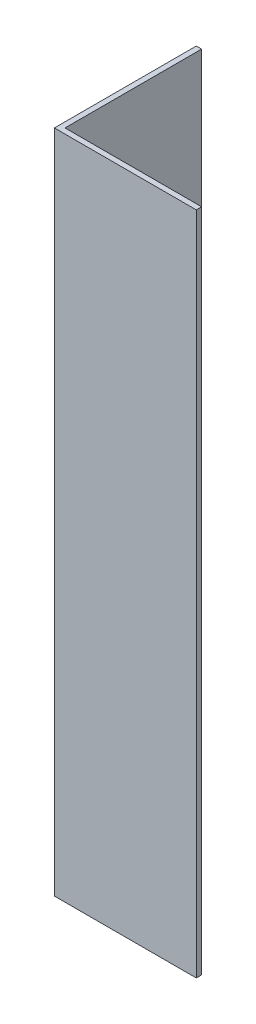
ISO-10303-21;
HEADER;
FILE_DESCRIPTION(('STEP AP214'),'2;1');
FILE_NAME('part.step','',(''),(''),'','','');
FILE_SCHEMA(('AUTOMOTIVE_DESIGN { 1 0 10303 214 1 1 1 1 }'));
ENDSEC;
DATA;
#1=APPLICATION_CONTEXT('core data for automotive mechanical design processes');
#2=APPLICATION_PROTOCOL_DEFINITION('international standard','automotive_design',2000,#1);
#3=PRODUCT_CONTEXT('',#1,'mechanical');
#4=PRODUCT('Part','Part','',(#3));
#5=PRODUCT_RELATED_PRODUCT_CATEGORY('part','',(#4));
#6=PRODUCT_DEFINITION_FORMATION('','',#4);
#7=PRODUCT_DEFINITION_CONTEXT('part definition',#1,'design');
#8=PRODUCT_DEFINITION('design','',#6,#7);
#9=PRODUCT_DEFINITION_SHAPE('','',#8);
#10=(LENGTH_UNIT() NAMED_UNIT(*) SI_UNIT(.MILLI.,.METRE.));
#11=(NAMED_UNIT(*) PLANE_ANGLE_UNIT() SI_UNIT($,.RADIAN.));
#12=(NAMED_UNIT(*) SI_UNIT($,.STERADIAN.) SOLID_ANGLE_UNIT());
#13=UNCERTAINTY_MEASURE_WITH_UNIT(LENGTH_MEASURE(1.E-05),#10,'distance_accuracy_value','');
#14=(GEOMETRIC_REPRESENTATION_CONTEXT(3) GLOBAL_UNCERTAINTY_ASSIGNED_CONTEXT((#13)) GLOBAL_UNIT_ASSIGNED_CONTEXT((#10,
#11,#12)) REPRESENTATION_CONTEXT('',''));
#15=CARTESIAN_POINT('',(0.,0.,0.));
#16=DIRECTION('',(0.,0.,1.));
#17=DIRECTION('',(1.,0.,0.));
#18=AXIS2_PLACEMENT_3D('',#15,#16,#17);
#19=CARTESIAN_POINT('',(20.,93.75,0.));
#20=DIRECTION('',(0.,0.,-1.));
#21=DIRECTION('',(-1.,0.,0.));
#22=AXIS2_PLACEMENT_3D('',#19,#20,#21);
#23=PLANE('',#22);
#24=DIRECTION('',(1.,0.,0.));
#25=VECTOR('',#24,1.);
#26=CARTESIAN_POINT('',(20.,0.,0.));
#27=LINE('',#26,#25);
#28=CARTESIAN_POINT('',(0.,0.,0.));
#29=VERTEX_POINT('',#28);
#30=CARTESIAN_POINT('',(20.,0.,0.));
#31=VERTEX_POINT('',#30);
#32=EDGE_CURVE('E119',#29,#31,#27,.T.);
#33=ORIENTED_EDGE('',*,*,#32,.T.);
#34=DIRECTION('',(0.,-1.,0.));
#35=VECTOR('',#34,1.);
#36=CARTESIAN_POINT('',(20.,93.75,0.));
#37=LINE('',#36,#35);
#38=CARTESIAN_POINT('',(20.,93.75,0.));
#39=VERTEX_POINT('',#38);
#40=EDGE_CURVE('E11',#39,#31,#37,.T.);
#41=ORIENTED_EDGE('',*,*,#40,.F.);
#42=DIRECTION('',(1.,0.,0.));
#43=VECTOR('',#42,1.);
#44=CARTESIAN_POINT('',(20.,93.75,0.));
#45=LINE('',#44,#43);
#46=CARTESIAN_POINT('',(0.,93.75,0.));
#47=VERTEX_POINT('',#46);
#48=EDGE_CURVE('E129',#47,#39,#45,.T.);
#49=ORIENTED_EDGE('',*,*,#48,.F.);
#50=DIRECTION('',(0.,-1.,0.));
#51=VECTOR('',#50,1.);
#52=CARTESIAN_POINT('',(0.,93.75,0.));
#53=LINE('',#52,#51);
#54=EDGE_CURVE('E115',#47,#29,#53,.T.);
#55=ORIENTED_EDGE('',*,*,#54,.T.);
#56=EDGE_LOOP('',(#33,#41,#49,#55));
#57=FACE_BOUND('',#56,.T.);
#58=ADVANCED_FACE('F35',(#57),#23,.F.);
#59=CARTESIAN_POINT('',(20.,93.75,-0.75));
#60=DIRECTION('',(-1.,0.,0.));
#61=DIRECTION('',(0.,0.,1.));
#62=AXIS2_PLACEMENT_3D('',#59,#60,#61);
#63=PLANE('',#62);
#64=DIRECTION('',(0.,0.,-1.));
#65=VECTOR('',#64,1.);
#66=CARTESIAN_POINT('',(20.,0.,-0.75));
#67=LINE('',#66,#65);
#68=CARTESIAN_POINT('',(20.,0.,-0.75));
#69=VERTEX_POINT('',#68);
#70=EDGE_CURVE('E122',#31,#69,#67,.T.);
#71=ORIENTED_EDGE('',*,*,#70,.T.);
#72=DIRECTION('',(0.,-1.,0.));
#73=VECTOR('',#72,1.);
#74=CARTESIAN_POINT('',(20.,93.75,-0.75));
#75=LINE('',#74,#73);
#76=CARTESIAN_POINT('',(20.,93.75,-0.75));
#77=VERTEX_POINT('',#76);
#78=EDGE_CURVE('E43',#77,#69,#75,.T.);
#79=ORIENTED_EDGE('',*,*,#78,.F.);
#80=DIRECTION('',(0.,0.,-1.));
#81=VECTOR('',#80,1.);
#82=CARTESIAN_POINT('',(20.,93.75,-0.75));
#83=LINE('',#82,#81);
#84=EDGE_CURVE('E88',#39,#77,#83,.T.);
#85=ORIENTED_EDGE('',*,*,#84,.F.);
#86=ORIENTED_EDGE('',*,*,#40,.T.);
#87=EDGE_LOOP('',(#71,#79,#85,#86));
#88=FACE_BOUND('',#87,.T.);
#89=ADVANCED_FACE('F153',(#88),#63,.F.);
#90=CARTESIAN_POINT('',(0.749999999999998,93.75,-0.749999999999998));
#91=DIRECTION('',(0.,0.,1.));
#92=DIRECTION('',(1.,0.,0.));
#93=AXIS2_PLACEMENT_3D('',#90,#91,#92);
#94=PLANE('',#93);
#95=DIRECTION('',(-1.,0.,0.));
#96=VECTOR('',#95,1.);
#97=CARTESIAN_POINT('',(0.749999999999998,0.,-0.749999999999998));
#98=LINE('',#97,#96);
#99=CARTESIAN_POINT('',(0.749999999999998,0.,-0.749999999999998));
#100=VERTEX_POINT('',#99);
#101=EDGE_CURVE('E124',#69,#100,#98,.T.);
#102=ORIENTED_EDGE('',*,*,#101,.T.);
#103=DIRECTION('',(0.,-1.,0.));
#104=VECTOR('',#103,1.);
#105=CARTESIAN_POINT('',(0.749999999999998,93.75,-0.749999999999998));
#106=LINE('',#105,#104);
#107=CARTESIAN_POINT('',(0.749999999999998,93.75,-0.749999999999998));
#108=VERTEX_POINT('',#107);
#109=EDGE_CURVE('E110',#108,#100,#106,.T.);
#110=ORIENTED_EDGE('',*,*,#109,.F.);
#111=DIRECTION('',(-1.,0.,0.));
#112=VECTOR('',#111,1.);
#113=CARTESIAN_POINT('',(0.749999999999998,93.75,-0.749999999999998));
#114=LINE('',#113,#112);
#115=EDGE_CURVE('E101',#77,#108,#114,.T.);
#116=ORIENTED_EDGE('',*,*,#115,.F.);
#117=ORIENTED_EDGE('',*,*,#78,.T.);
#118=EDGE_LOOP('',(#102,#110,#116,#117));
#119=FACE_BOUND('',#118,.T.);
#120=ADVANCED_FACE('F135',(#119),#94,.F.);
#121=CARTESIAN_POINT('',(0.749999999999998,93.75,-20.));
#122=DIRECTION('',(-1.,0.,0.));
#123=DIRECTION('',(0.,0.,1.));
#124=AXIS2_PLACEMENT_3D('',#121,#122,#123);
#125=PLANE('',#124);
#126=DIRECTION('',(0.,0.,-1.));
#127=VECTOR('',#126,1.);
#128=CARTESIAN_POINT('',(0.749999999999998,0.,-20.));
#129=LINE('',#128,#127);
#130=CARTESIAN_POINT('',(0.749999999999998,0.,-20.));
#131=VERTEX_POINT('',#130);
#132=EDGE_CURVE('E109',#100,#131,#129,.T.);
#133=ORIENTED_EDGE('',*,*,#132,.T.);
#134=DIRECTION('',(0.,-1.,0.));
#135=VECTOR('',#134,1.);
#136=CARTESIAN_POINT('',(0.749999999999998,93.75,-20.));
#137=LINE('',#136,#135);
#138=CARTESIAN_POINT('',(0.749999999999998,93.75,-20.));
#139=VERTEX_POINT('',#138);
#140=EDGE_CURVE('E106',#139,#131,#137,.T.);
#141=ORIENTED_EDGE('',*,*,#140,.F.);
#142=DIRECTION('',(0.,0.,-1.));
#143=VECTOR('',#142,1.);
#144=CARTESIAN_POINT('',(0.749999999999998,93.75,-20.));
#145=LINE('',#144,#143);
#146=EDGE_CURVE('E95',#108,#139,#145,.T.);
#147=ORIENTED_EDGE('',*,*,#146,.F.);
#148=ORIENTED_EDGE('',*,*,#109,.T.);
#149=EDGE_LOOP('',(#133,#141,#147,#148));
#150=FACE_BOUND('',#149,.T.);
#151=ADVANCED_FACE('F107',(#150),#125,.F.);
#152=CARTESIAN_POINT('',(0.,93.75,-20.));
#153=DIRECTION('',(0.,0.,1.));
#154=DIRECTION('',(1.,0.,0.));
#155=AXIS2_PLACEMENT_3D('',#152,#153,#154);
#156=PLANE('',#155);
#157=DIRECTION('',(-1.,0.,0.));
#158=VECTOR('',#157,1.);
#159=CARTESIAN_POINT('',(0.,0.,-20.));
#160=LINE('',#159,#158);
#161=CARTESIAN_POINT('',(0.,0.,-20.));
#162=VERTEX_POINT('',#161);
#163=EDGE_CURVE('E74',#131,#162,#160,.T.);
#164=ORIENTED_EDGE('',*,*,#163,.T.);
#165=DIRECTION('',(0.,-1.,0.));
#166=VECTOR('',#165,1.);
#167=CARTESIAN_POINT('',(0.,93.75,-20.));
#168=LINE('',#167,#166);
#169=CARTESIAN_POINT('',(0.,93.75,-20.));
#170=VERTEX_POINT('',#169);
#171=EDGE_CURVE('E111',#170,#162,#168,.T.);
#172=ORIENTED_EDGE('',*,*,#171,.F.);
#173=DIRECTION('',(-1.,0.,0.));
#174=VECTOR('',#173,1.);
#175=CARTESIAN_POINT('',(0.,93.75,-20.));
#176=LINE('',#175,#174);
#177=EDGE_CURVE('E99',#139,#170,#176,.T.);
#178=ORIENTED_EDGE('',*,*,#177,.F.);
#179=ORIENTED_EDGE('',*,*,#140,.T.);
#180=EDGE_LOOP('',(#164,#172,#178,#179));
#181=FACE_BOUND('',#180,.T.);
#182=ADVANCED_FACE('F113',(#181),#156,.F.);
#183=CARTESIAN_POINT('',(0.,93.75,0.));
#184=DIRECTION('',(1.,0.,0.));
#185=DIRECTION('',(0.,0.,-1.));
#186=AXIS2_PLACEMENT_3D('',#183,#184,#185);
#187=PLANE('',#186);
#188=DIRECTION('',(0.,0.,1.));
#189=VECTOR('',#188,1.);
#190=CARTESIAN_POINT('',(0.,0.,0.));
#191=LINE('',#190,#189);
#192=EDGE_CURVE('E80',#162,#29,#191,.T.);
#193=ORIENTED_EDGE('',*,*,#192,.T.);
#194=ORIENTED_EDGE('',*,*,#54,.F.);
#195=DIRECTION('',(0.,0.,1.));
#196=VECTOR('',#195,1.);
#197=CARTESIAN_POINT('',(0.,93.75,0.));
#198=LINE('',#197,#196);
#199=EDGE_CURVE('E51',#170,#47,#198,.T.);
#200=ORIENTED_EDGE('',*,*,#199,.F.);
#201=ORIENTED_EDGE('',*,*,#171,.T.);
#202=EDGE_LOOP('',(#193,#194,#200,#201));
#203=FACE_BOUND('',#202,.T.);
#204=ADVANCED_FACE('F142',(#203),#187,.F.);
#205=CARTESIAN_POINT('',(0.,93.75,0.));
#206=DIRECTION('',(0.,-1.,0.));
#207=DIRECTION('',(0.,0.,-1.));
#208=AXIS2_PLACEMENT_3D('',#205,#206,#207);
#209=PLANE('',#208);
#210=ORIENTED_EDGE('',*,*,#48,.T.);
#211=ORIENTED_EDGE('',*,*,#84,.T.);
#212=ORIENTED_EDGE('',*,*,#115,.T.);
#213=ORIENTED_EDGE('',*,*,#146,.T.);
#214=ORIENTED_EDGE('',*,*,#177,.T.);
#215=ORIENTED_EDGE('',*,*,#199,.T.);
#216=EDGE_LOOP('',(#210,#211,#212,#213,#214,#215));
#217=FACE_BOUND('',#216,.T.);
#218=ADVANCED_FACE('F97',(#217),#209,.F.);
#219=CARTESIAN_POINT('',(0.,0.,0.));
#220=DIRECTION('',(0.,-1.,0.));
#221=DIRECTION('',(0.,0.,-1.));
#222=AXIS2_PLACEMENT_3D('',#219,#220,#221);
#223=PLANE('',#222);
#224=ORIENTED_EDGE('',*,*,#32,.F.);
#225=ORIENTED_EDGE('',*,*,#192,.F.);
#226=ORIENTED_EDGE('',*,*,#163,.F.);
#227=ORIENTED_EDGE('',*,*,#132,.F.);
#228=ORIENTED_EDGE('',*,*,#101,.F.);
#229=ORIENTED_EDGE('',*,*,#70,.F.);
#230=EDGE_LOOP('',(#224,#225,#226,#227,#228,#229));
#231=FACE_BOUND('',#230,.T.);
#232=ADVANCED_FACE('F138',(#231),#223,.T.);
#233=CLOSED_SHELL('',(#58,#89,#120,#151,#182,#204,#218,#232));
#234=MANIFOLD_SOLID_BREP('B2',#233);
#235=ADVANCED_BREP_SHAPE_REPRESENTATION('',(#18,#234),#14);
#236=SHAPE_DEFINITION_REPRESENTATION(#9,#235);
ENDSEC;
END-ISO-10303-21;
